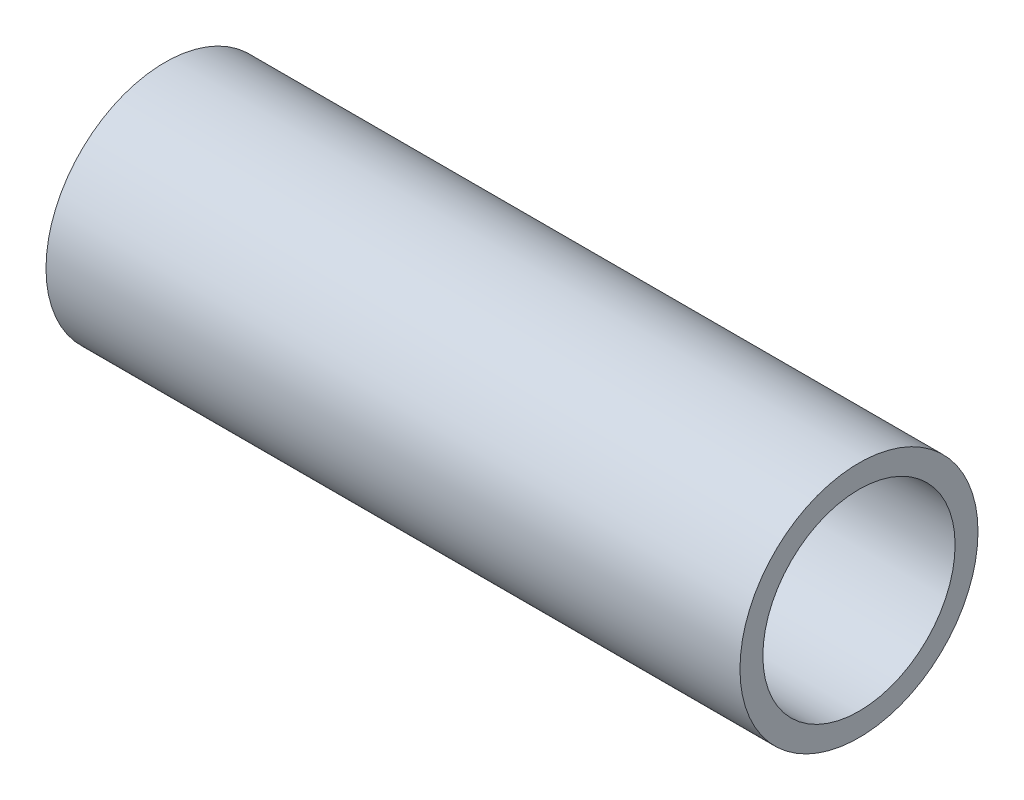
ISO-10303-21;
HEADER;
FILE_DESCRIPTION(('STEP AP214'),'2;1');
FILE_NAME('part.step','',(''),(''),'','','');
FILE_SCHEMA(('AUTOMOTIVE_DESIGN { 1 0 10303 214 1 1 1 1 }'));
ENDSEC;
DATA;
#1=APPLICATION_CONTEXT('core data for automotive mechanical design processes');
#2=APPLICATION_PROTOCOL_DEFINITION('international standard','automotive_design',2000,#1);
#3=PRODUCT_CONTEXT('',#1,'mechanical');
#4=PRODUCT('Part','Part','',(#3));
#5=PRODUCT_RELATED_PRODUCT_CATEGORY('part','',(#4));
#6=PRODUCT_DEFINITION_FORMATION('','',#4);
#7=PRODUCT_DEFINITION_CONTEXT('part definition',#1,'design');
#8=PRODUCT_DEFINITION('design','',#6,#7);
#9=PRODUCT_DEFINITION_SHAPE('','',#8);
#10=(LENGTH_UNIT() NAMED_UNIT(*) SI_UNIT(.MILLI.,.METRE.));
#11=(NAMED_UNIT(*) PLANE_ANGLE_UNIT() SI_UNIT($,.RADIAN.));
#12=(NAMED_UNIT(*) SI_UNIT($,.STERADIAN.) SOLID_ANGLE_UNIT());
#13=UNCERTAINTY_MEASURE_WITH_UNIT(LENGTH_MEASURE(1.E-05),#10,'distance_accuracy_value','');
#14=(GEOMETRIC_REPRESENTATION_CONTEXT(3) GLOBAL_UNCERTAINTY_ASSIGNED_CONTEXT((#13)) GLOBAL_UNIT_ASSIGNED_CONTEXT((#10,
#11,#12)) REPRESENTATION_CONTEXT('',''));
#15=CARTESIAN_POINT('',(0.,0.,0.));
#16=DIRECTION('',(0.,0.,1.));
#17=DIRECTION('',(1.,0.,0.));
#18=AXIS2_PLACEMENT_3D('',#15,#16,#17);
#19=CARTESIAN_POINT('',(28.8798,0.,0.));
#20=DIRECTION('',(-1.,0.,0.));
#21=DIRECTION('',(0.,0.,1.));
#22=AXIS2_PLACEMENT_3D('',#19,#20,#21);
#23=CYLINDRICAL_SURFACE('',#22,4.);
#24=CARTESIAN_POINT('',(0.,0.,0.));
#25=DIRECTION('',(-1.,0.,0.));
#26=DIRECTION('',(0.,0.,1.));
#27=AXIS2_PLACEMENT_3D('',#24,#25,#26);
#28=CIRCLE('',#27,4.);
#29=CARTESIAN_POINT('',(0.,0.,4.));
#30=VERTEX_POINT('',#29);
#31=EDGE_CURVE('E27',#30,#30,#28,.T.);
#32=ORIENTED_EDGE('',*,*,#31,.T.);
#33=EDGE_LOOP('',(#32));
#34=FACE_BOUND('',#33,.T.);
#35=CARTESIAN_POINT('',(28.8798,0.,0.));
#36=DIRECTION('',(-1.,0.,0.));
#37=DIRECTION('',(0.,0.,1.));
#38=AXIS2_PLACEMENT_3D('',#35,#36,#37);
#39=CIRCLE('',#38,4.);
#40=CARTESIAN_POINT('',(28.8798,0.,4.));
#41=VERTEX_POINT('',#40);
#42=EDGE_CURVE('E18',#41,#41,#39,.T.);
#43=ORIENTED_EDGE('',*,*,#42,.F.);
#44=EDGE_LOOP('',(#43));
#45=FACE_BOUND('',#44,.T.);
#46=ADVANCED_FACE('F15',(#34,#45),#23,.F.);
#47=CARTESIAN_POINT('',(28.8798,0.,0.));
#48=DIRECTION('',(1.,0.,0.));
#49=DIRECTION('',(0.,0.,-1.));
#50=AXIS2_PLACEMENT_3D('',#47,#48,#49);
#51=PLANE('',#50);
#52=ORIENTED_EDGE('',*,*,#42,.T.);
#53=EDGE_LOOP('',(#52));
#54=FACE_BOUND('',#53,.T.);
#55=CARTESIAN_POINT('',(28.8798,0.,0.));
#56=DIRECTION('',(-1.,0.,0.));
#57=DIRECTION('',(0.,0.,1.));
#58=AXIS2_PLACEMENT_3D('',#55,#56,#57);
#59=CIRCLE('',#58,4.953);
#60=CARTESIAN_POINT('',(28.8798,0.,4.953));
#61=VERTEX_POINT('',#60);
#62=EDGE_CURVE('E22',#61,#61,#59,.T.);
#63=ORIENTED_EDGE('',*,*,#62,.F.);
#64=EDGE_LOOP('',(#63));
#65=FACE_BOUND('',#64,.T.);
#66=ADVANCED_FACE('F35',(#54,#65),#51,.T.);
#67=CARTESIAN_POINT('',(0.,0.,0.));
#68=DIRECTION('',(1.,0.,0.));
#69=DIRECTION('',(0.,0.,-1.));
#70=AXIS2_PLACEMENT_3D('',#67,#68,#69);
#71=PLANE('',#70);
#72=ORIENTED_EDGE('',*,*,#31,.F.);
#73=EDGE_LOOP('',(#72));
#74=FACE_BOUND('',#73,.T.);
#75=CARTESIAN_POINT('',(0.,0.,0.));
#76=DIRECTION('',(-1.,0.,0.));
#77=DIRECTION('',(0.,0.,1.));
#78=AXIS2_PLACEMENT_3D('',#75,#76,#77);
#79=CIRCLE('',#78,4.953);
#80=CARTESIAN_POINT('',(0.,0.,4.953));
#81=VERTEX_POINT('',#80);
#82=EDGE_CURVE('E10',#81,#81,#79,.F.);
#83=ORIENTED_EDGE('',*,*,#82,.F.);
#84=EDGE_LOOP('',(#83));
#85=FACE_BOUND('',#84,.T.);
#86=ADVANCED_FACE('F43',(#74,#85),#71,.F.);
#87=CARTESIAN_POINT('',(28.8798,0.,0.));
#88=DIRECTION('',(-1.,0.,0.));
#89=DIRECTION('',(0.,0.,1.));
#90=AXIS2_PLACEMENT_3D('',#87,#88,#89);
#91=CYLINDRICAL_SURFACE('',#90,4.953);
#92=ORIENTED_EDGE('',*,*,#82,.T.);
#93=EDGE_LOOP('',(#92));
#94=FACE_BOUND('',#93,.T.);
#95=ORIENTED_EDGE('',*,*,#62,.T.);
#96=EDGE_LOOP('',(#95));
#97=FACE_BOUND('',#96,.T.);
#98=ADVANCED_FACE('F44',(#94,#97),#91,.T.);
#99=CLOSED_SHELL('',(#46,#66,#86,#98));
#100=MANIFOLD_SOLID_BREP('B1',#99);
#101=ADVANCED_BREP_SHAPE_REPRESENTATION('',(#18,#100),#14);
#102=SHAPE_DEFINITION_REPRESENTATION(#9,#101);
ENDSEC;
END-ISO-10303-21;
